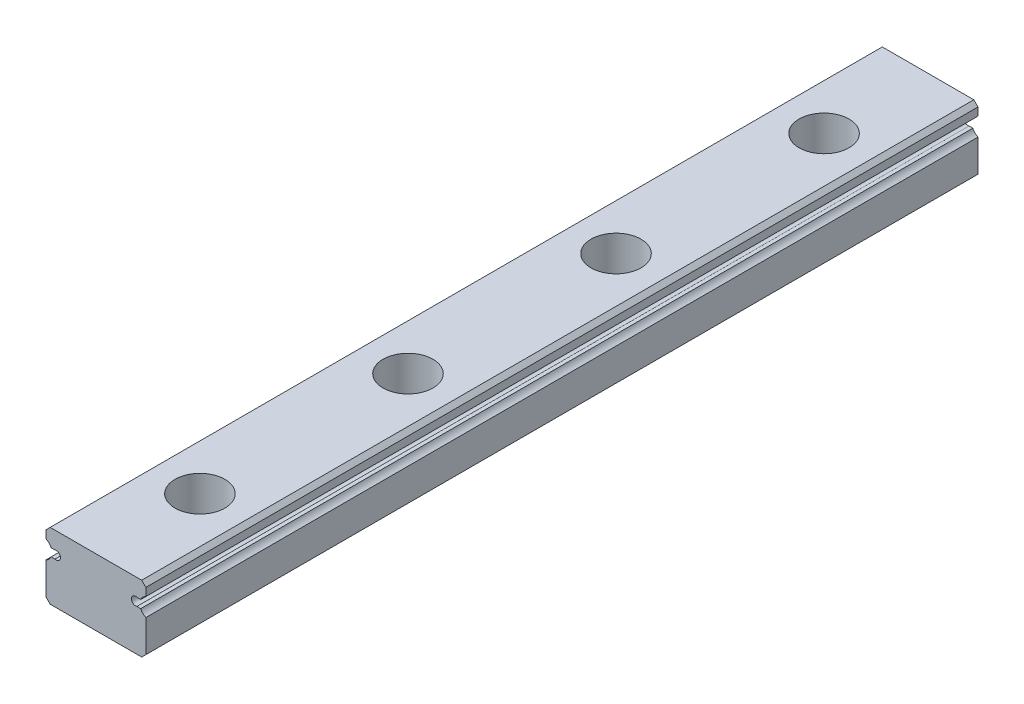
ISO-10303-21;
HEADER;
FILE_DESCRIPTION(('STEP AP214'),'2;1');
FILE_NAME('part.step','',(''),(''),'','','');
FILE_SCHEMA(('AUTOMOTIVE_DESIGN { 1 0 10303 214 1 1 1 1 }'));
ENDSEC;
DATA;
#1=APPLICATION_CONTEXT('core data for automotive mechanical design processes');
#2=APPLICATION_PROTOCOL_DEFINITION('international standard','automotive_design',2000,#1);
#3=PRODUCT_CONTEXT('',#1,'mechanical');
#4=PRODUCT('Part','Part','',(#3));
#5=PRODUCT_RELATED_PRODUCT_CATEGORY('part','',(#4));
#6=PRODUCT_DEFINITION_FORMATION('','',#4);
#7=PRODUCT_DEFINITION_CONTEXT('part definition',#1,'design');
#8=PRODUCT_DEFINITION('design','',#6,#7);
#9=PRODUCT_DEFINITION_SHAPE('','',#8);
#10=(LENGTH_UNIT() NAMED_UNIT(*) SI_UNIT(.MILLI.,.METRE.));
#11=(NAMED_UNIT(*) PLANE_ANGLE_UNIT() SI_UNIT($,.RADIAN.));
#12=(NAMED_UNIT(*) SI_UNIT($,.STERADIAN.) SOLID_ANGLE_UNIT());
#13=UNCERTAINTY_MEASURE_WITH_UNIT(LENGTH_MEASURE(1.E-05),#10,'distance_accuracy_value','');
#14=(GEOMETRIC_REPRESENTATION_CONTEXT(3) GLOBAL_UNCERTAINTY_ASSIGNED_CONTEXT((#13)) GLOBAL_UNIT_ASSIGNED_CONTEXT((#10,
#11,#12)) REPRESENTATION_CONTEXT('',''));
#15=CARTESIAN_POINT('',(0.,0.,0.));
#16=DIRECTION('',(0.,0.,1.));
#17=DIRECTION('',(1.,0.,0.));
#18=AXIS2_PLACEMENT_3D('',#15,#16,#17);
#19=CARTESIAN_POINT('',(6.,0.,100.));
#20=DIRECTION('',(-1.,0.,0.));
#21=DIRECTION('',(0.,0.,1.));
#22=AXIS2_PLACEMENT_3D('',#19,#20,#21);
#23=PLANE('',#22);
#24=DIRECTION('',(0.,1.,0.));
#25=VECTOR('',#24,1.);
#26=CARTESIAN_POINT('',(6.,0.,0.));
#27=LINE('',#26,#25);
#28=CARTESIAN_POINT('',(6.,-3.5,0.));
#29=VERTEX_POINT('',#28);
#30=CARTESIAN_POINT('',(6.,0.368911094364901,0.));
#31=VERTEX_POINT('',#30);
#32=EDGE_CURVE('E219',#29,#31,#27,.T.);
#33=ORIENTED_EDGE('',*,*,#32,.T.);
#34=DIRECTION('',(0.,0.,-1.));
#35=VECTOR('',#34,1.);
#36=CARTESIAN_POINT('',(6.,0.368911094364901,100.));
#37=LINE('',#36,#35);
#38=CARTESIAN_POINT('',(6.,0.368911094364901,100.));
#39=VERTEX_POINT('',#38);
#40=EDGE_CURVE('E11',#39,#31,#37,.T.);
#41=ORIENTED_EDGE('',*,*,#40,.F.);
#42=DIRECTION('',(0.,1.,0.));
#43=VECTOR('',#42,1.);
#44=CARTESIAN_POINT('',(6.,0.,100.));
#45=LINE('',#44,#43);
#46=CARTESIAN_POINT('',(6.,-3.5,100.));
#47=VERTEX_POINT('',#46);
#48=EDGE_CURVE('E291',#47,#39,#45,.T.);
#49=ORIENTED_EDGE('',*,*,#48,.F.);
#50=DIRECTION('',(0.,0.,-1.));
#51=VECTOR('',#50,1.);
#52=CARTESIAN_POINT('',(6.,-3.5,100.));
#53=LINE('',#52,#51);
#54=EDGE_CURVE('E215',#47,#29,#53,.T.);
#55=ORIENTED_EDGE('',*,*,#54,.T.);
#56=EDGE_LOOP('',(#33,#41,#49,#55));
#57=FACE_BOUND('',#56,.T.);
#58=ADVANCED_FACE('F47',(#57),#23,.F.);
#59=CARTESIAN_POINT('',(6.475,1.46,100.));
#60=DIRECTION('',(0.,0.,-1.));
#61=DIRECTION('',(-1.,0.,0.));
#62=AXIS2_PLACEMENT_3D('',#59,#60,#61);
#63=CYLINDRICAL_SURFACE('',#62,1.19);
#64=CARTESIAN_POINT('',(6.475,1.46,0.));
#65=DIRECTION('',(0.,0.,1.));
#66=DIRECTION('',(1.,0.,0.));
#67=AXIS2_PLACEMENT_3D('',#64,#65,#66);
#68=CIRCLE('',#67,1.19);
#69=CARTESIAN_POINT('',(5.3839110943649,0.985,0.));
#70=VERTEX_POINT('',#69);
#71=EDGE_CURVE('E223',#31,#70,#68,.F.);
#72=ORIENTED_EDGE('',*,*,#71,.T.);
#73=DIRECTION('',(0.,0.,-1.));
#74=VECTOR('',#73,1.);
#75=CARTESIAN_POINT('',(5.3839110943649,0.985,100.));
#76=LINE('',#75,#74);
#77=CARTESIAN_POINT('',(5.3839110943649,0.985,100.));
#78=VERTEX_POINT('',#77);
#79=EDGE_CURVE('E56',#78,#70,#76,.T.);
#80=ORIENTED_EDGE('',*,*,#79,.F.);
#81=CARTESIAN_POINT('',(6.475,1.46,100.));
#82=DIRECTION('',(0.,0.,1.));
#83=DIRECTION('',(1.,0.,0.));
#84=AXIS2_PLACEMENT_3D('',#81,#82,#83);
#85=CIRCLE('',#84,1.19);
#86=EDGE_CURVE('E139',#39,#78,#85,.F.);
#87=ORIENTED_EDGE('',*,*,#86,.F.);
#88=ORIENTED_EDGE('',*,*,#40,.T.);
#89=EDGE_LOOP('',(#72,#80,#87,#88));
#90=FACE_BOUND('',#89,.T.);
#91=ADVANCED_FACE('F430',(#90),#63,.F.);
#92=CARTESIAN_POINT('',(0.,0.985000000000015,100.));
#93=DIRECTION('',(0.,-1.,0.));
#94=DIRECTION('',(1.,0.,0.));
#95=AXIS2_PLACEMENT_3D('',#92,#93,#94);
#96=PLANE('',#95);
#97=DIRECTION('',(-1.,0.,0.));
#98=VECTOR('',#97,1.);
#99=CARTESIAN_POINT('',(0.,0.985000000000015,0.));
#100=LINE('',#99,#98);
#101=CARTESIAN_POINT('',(4.92112494995996,0.985000000000002,0.));
#102=VERTEX_POINT('',#101);
#103=EDGE_CURVE('E227',#70,#102,#100,.T.);
#104=ORIENTED_EDGE('',*,*,#103,.T.);
#105=DIRECTION('',(0.,0.,-1.));
#106=VECTOR('',#105,1.);
#107=CARTESIAN_POINT('',(4.92112494995996,0.985000000000002,100.));
#108=LINE('',#107,#106);
#109=CARTESIAN_POINT('',(4.92112494995996,0.985000000000002,100.));
#110=VERTEX_POINT('',#109);
#111=EDGE_CURVE('E339',#110,#102,#108,.T.);
#112=ORIENTED_EDGE('',*,*,#111,.F.);
#113=DIRECTION('',(-1.,0.,0.));
#114=VECTOR('',#113,1.);
#115=CARTESIAN_POINT('',(0.,0.985000000000015,100.));
#116=LINE('',#115,#114);
#117=EDGE_CURVE('E349',#78,#110,#116,.T.);
#118=ORIENTED_EDGE('',*,*,#117,.F.);
#119=ORIENTED_EDGE('',*,*,#79,.T.);
#120=EDGE_LOOP('',(#104,#112,#118,#119));
#121=FACE_BOUND('',#120,.T.);
#122=ADVANCED_FACE('F347',(#121),#96,.F.);
#123=CARTESIAN_POINT('',(4.765,1.46,100.));
#124=DIRECTION('',(0.,0.,-1.));
#125=DIRECTION('',(-1.,0.,0.));
#126=AXIS2_PLACEMENT_3D('',#123,#124,#125);
#127=CYLINDRICAL_SURFACE('',#126,0.5);
#128=CARTESIAN_POINT('',(4.765,1.46,0.));
#129=DIRECTION('',(0.,0.,1.));
#130=DIRECTION('',(1.,0.,0.));
#131=AXIS2_PLACEMENT_3D('',#128,#129,#130);
#132=CIRCLE('',#131,0.5);
#133=CARTESIAN_POINT('',(4.92112494995996,1.935,0.));
#134=VERTEX_POINT('',#133);
#135=EDGE_CURVE('E230',#102,#134,#132,.F.);
#136=ORIENTED_EDGE('',*,*,#135,.T.);
#137=DIRECTION('',(0.,0.,-1.));
#138=VECTOR('',#137,1.);
#139=CARTESIAN_POINT('',(4.92112494995996,1.935,100.));
#140=LINE('',#139,#138);
#141=CARTESIAN_POINT('',(4.92112494995996,1.935,100.));
#142=VERTEX_POINT('',#141);
#143=EDGE_CURVE('E336',#142,#134,#140,.T.);
#144=ORIENTED_EDGE('',*,*,#143,.F.);
#145=CARTESIAN_POINT('',(4.765,1.46,100.));
#146=DIRECTION('',(0.,0.,1.));
#147=DIRECTION('',(1.,0.,0.));
#148=AXIS2_PLACEMENT_3D('',#145,#146,#147);
#149=CIRCLE('',#148,0.5);
#150=EDGE_CURVE('E361',#110,#142,#149,.F.);
#151=ORIENTED_EDGE('',*,*,#150,.F.);
#152=ORIENTED_EDGE('',*,*,#111,.T.);
#153=EDGE_LOOP('',(#136,#144,#151,#152));
#154=FACE_BOUND('',#153,.T.);
#155=ADVANCED_FACE('F358',(#154),#127,.F.);
#156=CARTESIAN_POINT('',(0.,1.93500000000002,100.));
#157=DIRECTION('',(0.,-1.,0.));
#158=DIRECTION('',(1.,0.,0.));
#159=AXIS2_PLACEMENT_3D('',#156,#157,#158);
#160=PLANE('',#159);
#161=DIRECTION('',(-1.,0.,0.));
#162=VECTOR('',#161,1.);
#163=CARTESIAN_POINT('',(0.,1.93500000000002,0.));
#164=LINE('',#163,#162);
#165=CARTESIAN_POINT('',(5.3839110943649,1.935,0.));
#166=VERTEX_POINT('',#165);
#167=EDGE_CURVE('E234',#166,#134,#164,.T.);
#168=ORIENTED_EDGE('',*,*,#167,.F.);
#169=DIRECTION('',(0.,0.,-1.));
#170=VECTOR('',#169,1.);
#171=CARTESIAN_POINT('',(5.3839110943649,1.935,100.));
#172=LINE('',#171,#170);
#173=CARTESIAN_POINT('',(5.3839110943649,1.935,100.));
#174=VERTEX_POINT('',#173);
#175=EDGE_CURVE('E333',#174,#166,#172,.T.);
#176=ORIENTED_EDGE('',*,*,#175,.F.);
#177=DIRECTION('',(-1.,0.,0.));
#178=VECTOR('',#177,1.);
#179=CARTESIAN_POINT('',(0.,1.93500000000002,100.));
#180=LINE('',#179,#178);
#181=EDGE_CURVE('E364',#174,#142,#180,.T.);
#182=ORIENTED_EDGE('',*,*,#181,.T.);
#183=ORIENTED_EDGE('',*,*,#143,.T.);
#184=EDGE_LOOP('',(#168,#176,#182,#183));
#185=FACE_BOUND('',#184,.T.);
#186=ADVANCED_FACE('F441',(#185),#160,.T.);
#187=CARTESIAN_POINT('',(6.475,1.46,100.));
#188=DIRECTION('',(0.,0.,-1.));
#189=DIRECTION('',(-1.,0.,0.));
#190=AXIS2_PLACEMENT_3D('',#187,#188,#189);
#191=CYLINDRICAL_SURFACE('',#190,1.19);
#192=CARTESIAN_POINT('',(6.475,1.46,0.));
#193=DIRECTION('',(0.,0.,1.));
#194=DIRECTION('',(1.,0.,0.));
#195=AXIS2_PLACEMENT_3D('',#192,#193,#194);
#196=CIRCLE('',#195,1.19);
#197=CARTESIAN_POINT('',(6.,2.5510889056351,0.));
#198=VERTEX_POINT('',#197);
#199=EDGE_CURVE('E238',#166,#198,#196,.F.);
#200=ORIENTED_EDGE('',*,*,#199,.T.);
#201=DIRECTION('',(0.,0.,-1.));
#202=VECTOR('',#201,1.);
#203=CARTESIAN_POINT('',(6.,2.5510889056351,100.));
#204=LINE('',#203,#202);
#205=CARTESIAN_POINT('',(6.,2.5510889056351,100.));
#206=VERTEX_POINT('',#205);
#207=EDGE_CURVE('E329',#206,#198,#204,.T.);
#208=ORIENTED_EDGE('',*,*,#207,.F.);
#209=CARTESIAN_POINT('',(6.475,1.46,100.));
#210=DIRECTION('',(0.,0.,1.));
#211=DIRECTION('',(1.,0.,0.));
#212=AXIS2_PLACEMENT_3D('',#209,#210,#211);
#213=CIRCLE('',#212,1.19);
#214=EDGE_CURVE('E368',#174,#206,#213,.F.);
#215=ORIENTED_EDGE('',*,*,#214,.F.);
#216=ORIENTED_EDGE('',*,*,#175,.T.);
#217=EDGE_LOOP('',(#200,#208,#215,#216));
#218=FACE_BOUND('',#217,.T.);
#219=ADVANCED_FACE('F444',(#218),#191,.F.);
#220=CARTESIAN_POINT('',(6.00000000000001,0.,100.));
#221=DIRECTION('',(-1.,0.,0.));
#222=DIRECTION('',(0.,-1.,0.));
#223=AXIS2_PLACEMENT_3D('',#220,#221,#222);
#224=PLANE('',#223);
#225=DIRECTION('',(0.,1.,0.));
#226=VECTOR('',#225,1.);
#227=CARTESIAN_POINT('',(6.00000000000001,0.,0.));
#228=LINE('',#227,#226);
#229=CARTESIAN_POINT('',(6.,3.5,0.));
#230=VERTEX_POINT('',#229);
#231=EDGE_CURVE('E241',#198,#230,#228,.T.);
#232=ORIENTED_EDGE('',*,*,#231,.T.);
#233=DIRECTION('',(0.,0.,-1.));
#234=VECTOR('',#233,1.);
#235=CARTESIAN_POINT('',(6.,3.5,100.));
#236=LINE('',#235,#234);
#237=CARTESIAN_POINT('',(6.,3.5,100.));
#238=VERTEX_POINT('',#237);
#239=EDGE_CURVE('E326',#238,#230,#236,.T.);
#240=ORIENTED_EDGE('',*,*,#239,.F.);
#241=DIRECTION('',(0.,1.,0.));
#242=VECTOR('',#241,1.);
#243=CARTESIAN_POINT('',(6.00000000000001,0.,100.));
#244=LINE('',#243,#242);
#245=EDGE_CURVE('E375',#206,#238,#244,.T.);
#246=ORIENTED_EDGE('',*,*,#245,.F.);
#247=ORIENTED_EDGE('',*,*,#207,.T.);
#248=EDGE_LOOP('',(#232,#240,#246,#247));
#249=FACE_BOUND('',#248,.T.);
#250=ADVANCED_FACE('F448',(#249),#224,.F.);
#251=CARTESIAN_POINT('',(4.74999999999999,4.75,100.));
#252=DIRECTION('',(0.707106781186547,0.707106781186548,0.));
#253=DIRECTION('',(-0.707106781186548,0.707106781186547,0.));
#254=AXIS2_PLACEMENT_3D('',#251,#252,#253);
#255=PLANE('',#254);
#256=DIRECTION('',(0.707106781186548,-0.707106781186547,0.));
#257=VECTOR('',#256,1.);
#258=CARTESIAN_POINT('',(4.74999999999999,4.75,0.));
#259=LINE('',#258,#257);
#260=CARTESIAN_POINT('',(5.5,4.,0.));
#261=VERTEX_POINT('',#260);
#262=EDGE_CURVE('E245',#261,#230,#259,.T.);
#263=ORIENTED_EDGE('',*,*,#262,.F.);
#264=DIRECTION('',(0.,0.,-1.));
#265=VECTOR('',#264,1.);
#266=CARTESIAN_POINT('',(5.5,4.,100.));
#267=LINE('',#266,#265);
#268=CARTESIAN_POINT('',(5.5,4.,100.));
#269=VERTEX_POINT('',#268);
#270=EDGE_CURVE('E323',#269,#261,#267,.T.);
#271=ORIENTED_EDGE('',*,*,#270,.F.);
#272=DIRECTION('',(0.707106781186548,-0.707106781186547,0.));
#273=VECTOR('',#272,1.);
#274=CARTESIAN_POINT('',(4.74999999999999,4.75,100.));
#275=LINE('',#274,#273);
#276=EDGE_CURVE('E378',#269,#238,#275,.T.);
#277=ORIENTED_EDGE('',*,*,#276,.T.);
#278=ORIENTED_EDGE('',*,*,#239,.T.);
#279=EDGE_LOOP('',(#263,#271,#277,#278));
#280=FACE_BOUND('',#279,.T.);
#281=ADVANCED_FACE('F452',(#280),#255,.T.);
#282=CARTESIAN_POINT('',(0.,4.,100.));
#283=DIRECTION('',(0.,-1.,0.));
#284=DIRECTION('',(1.,0.,0.));
#285=AXIS2_PLACEMENT_3D('',#282,#283,#284);
#286=PLANE('',#285);
#287=CARTESIAN_POINT('',(0.,4.,87.5));
#288=DIRECTION('',(0.,1.,0.));
#289=DIRECTION('',(-1.,0.,0.));
#290=AXIS2_PLACEMENT_3D('',#287,#288,#289);
#291=CIRCLE('',#290,3.);
#292=CARTESIAN_POINT('',(-3.,4.,87.5));
#293=VERTEX_POINT('',#292);
#294=EDGE_CURVE('E802',#293,#293,#291,.T.);
#295=ORIENTED_EDGE('',*,*,#294,.F.);
#296=EDGE_LOOP('',(#295));
#297=FACE_BOUND('',#296,.T.);
#298=CARTESIAN_POINT('',(0.,4.,62.5));
#299=DIRECTION('',(0.,1.,0.));
#300=DIRECTION('',(-1.,0.,0.));
#301=AXIS2_PLACEMENT_3D('',#298,#299,#300);
#302=CIRCLE('',#301,3.);
#303=CARTESIAN_POINT('',(-3.,4.,62.5));
#304=VERTEX_POINT('',#303);
#305=EDGE_CURVE('E816',#304,#304,#302,.T.);
#306=ORIENTED_EDGE('',*,*,#305,.F.);
#307=EDGE_LOOP('',(#306));
#308=FACE_BOUND('',#307,.T.);
#309=CARTESIAN_POINT('',(0.,4.,37.5));
#310=DIRECTION('',(0.,1.,0.));
#311=DIRECTION('',(-1.,0.,0.));
#312=AXIS2_PLACEMENT_3D('',#309,#310,#311);
#313=CIRCLE('',#312,3.);
#314=CARTESIAN_POINT('',(-3.,4.,37.5));
#315=VERTEX_POINT('',#314);
#316=EDGE_CURVE('E832',#315,#315,#313,.T.);
#317=ORIENTED_EDGE('',*,*,#316,.F.);
#318=EDGE_LOOP('',(#317));
#319=FACE_BOUND('',#318,.T.);
#320=CARTESIAN_POINT('',(0.,4.,12.5));
#321=DIRECTION('',(0.,1.,0.));
#322=DIRECTION('',(-1.,0.,0.));
#323=AXIS2_PLACEMENT_3D('',#320,#321,#322);
#324=CIRCLE('',#323,3.);
#325=CARTESIAN_POINT('',(-3.,4.,12.5));
#326=VERTEX_POINT('',#325);
#327=EDGE_CURVE('E849',#326,#326,#324,.T.);
#328=ORIENTED_EDGE('',*,*,#327,.F.);
#329=EDGE_LOOP('',(#328));
#330=FACE_BOUND('',#329,.T.);
#331=DIRECTION('',(-1.,0.,0.));
#332=VECTOR('',#331,1.);
#333=CARTESIAN_POINT('',(0.,4.,0.));
#334=LINE('',#333,#332);
#335=CARTESIAN_POINT('',(-5.5,4.,0.));
#336=VERTEX_POINT('',#335);
#337=EDGE_CURVE('E249',#261,#336,#334,.T.);
#338=ORIENTED_EDGE('',*,*,#337,.T.);
#339=DIRECTION('',(0.,0.,-1.));
#340=VECTOR('',#339,1.);
#341=CARTESIAN_POINT('',(-5.5,4.,100.));
#342=LINE('',#341,#340);
#343=CARTESIAN_POINT('',(-5.5,4.,100.));
#344=VERTEX_POINT('',#343);
#345=EDGE_CURVE('E319',#344,#336,#342,.T.);
#346=ORIENTED_EDGE('',*,*,#345,.F.);
#347=DIRECTION('',(-1.,0.,0.));
#348=VECTOR('',#347,1.);
#349=CARTESIAN_POINT('',(0.,4.,100.));
#350=LINE('',#349,#348);
#351=EDGE_CURVE('E382',#269,#344,#350,.T.);
#352=ORIENTED_EDGE('',*,*,#351,.F.);
#353=ORIENTED_EDGE('',*,*,#270,.T.);
#354=EDGE_LOOP('',(#338,#346,#352,#353));
#355=FACE_BOUND('',#354,.T.);
#356=ADVANCED_FACE('F456',(#297,#308,#319,#330,#355),#286,.F.);
#357=CARTESIAN_POINT('',(-4.75,4.75,100.));
#358=DIRECTION('',(0.707106781186547,-0.707106781186548,0.));
#359=DIRECTION('',(0.707106781186548,0.707106781186547,0.));
#360=AXIS2_PLACEMENT_3D('',#357,#358,#359);
#361=PLANE('',#360);
#362=DIRECTION('',(-0.707106781186548,-0.707106781186547,0.));
#363=VECTOR('',#362,1.);
#364=CARTESIAN_POINT('',(-4.75,4.75,0.));
#365=LINE('',#364,#363);
#366=CARTESIAN_POINT('',(-6.,3.5,0.));
#367=VERTEX_POINT('',#366);
#368=EDGE_CURVE('E252',#336,#367,#365,.T.);
#369=ORIENTED_EDGE('',*,*,#368,.T.);
#370=DIRECTION('',(0.,0.,-1.));
#371=VECTOR('',#370,1.);
#372=CARTESIAN_POINT('',(-6.,3.5,100.));
#373=LINE('',#372,#371);
#374=CARTESIAN_POINT('',(-6.,3.5,100.));
#375=VERTEX_POINT('',#374);
#376=EDGE_CURVE('E316',#375,#367,#373,.T.);
#377=ORIENTED_EDGE('',*,*,#376,.F.);
#378=DIRECTION('',(-0.707106781186548,-0.707106781186547,0.));
#379=VECTOR('',#378,1.);
#380=CARTESIAN_POINT('',(-4.75,4.75,100.));
#381=LINE('',#380,#379);
#382=EDGE_CURVE('E385',#344,#375,#381,.T.);
#383=ORIENTED_EDGE('',*,*,#382,.F.);
#384=ORIENTED_EDGE('',*,*,#345,.T.);
#385=EDGE_LOOP('',(#369,#377,#383,#384));
#386=FACE_BOUND('',#385,.T.);
#387=ADVANCED_FACE('F460',(#386),#361,.F.);
#388=CARTESIAN_POINT('',(-6.,0.,100.));
#389=DIRECTION('',(-1.,0.,0.));
#390=DIRECTION('',(0.,0.,1.));
#391=AXIS2_PLACEMENT_3D('',#388,#389,#390);
#392=PLANE('',#391);
#393=DIRECTION('',(0.,1.,0.));
#394=VECTOR('',#393,1.);
#395=CARTESIAN_POINT('',(-6.,0.,0.));
#396=LINE('',#395,#394);
#397=CARTESIAN_POINT('',(-6.,2.5510889056351,0.));
#398=VERTEX_POINT('',#397);
#399=EDGE_CURVE('E256',#398,#367,#396,.T.);
#400=ORIENTED_EDGE('',*,*,#399,.F.);
#401=DIRECTION('',(0.,0.,-1.));
#402=VECTOR('',#401,1.);
#403=CARTESIAN_POINT('',(-6.,2.5510889056351,100.));
#404=LINE('',#403,#402);
#405=CARTESIAN_POINT('',(-6.,2.5510889056351,100.));
#406=VERTEX_POINT('',#405);
#407=EDGE_CURVE('E313',#406,#398,#404,.T.);
#408=ORIENTED_EDGE('',*,*,#407,.F.);
#409=DIRECTION('',(0.,1.,0.));
#410=VECTOR('',#409,1.);
#411=CARTESIAN_POINT('',(-6.,0.,100.));
#412=LINE('',#411,#410);
#413=EDGE_CURVE('E388',#406,#375,#412,.T.);
#414=ORIENTED_EDGE('',*,*,#413,.T.);
#415=ORIENTED_EDGE('',*,*,#376,.T.);
#416=EDGE_LOOP('',(#400,#408,#414,#415));
#417=FACE_BOUND('',#416,.T.);
#418=ADVANCED_FACE('F464',(#417),#392,.T.);
#419=CARTESIAN_POINT('',(-6.475,1.46,100.));
#420=DIRECTION('',(0.,0.,-1.));
#421=DIRECTION('',(-1.,0.,0.));
#422=AXIS2_PLACEMENT_3D('',#419,#420,#421);
#423=CYLINDRICAL_SURFACE('',#422,1.19);
#424=CARTESIAN_POINT('',(-6.475,1.46,0.));
#425=DIRECTION('',(0.,0.,1.));
#426=DIRECTION('',(1.,0.,0.));
#427=AXIS2_PLACEMENT_3D('',#424,#425,#426);
#428=CIRCLE('',#427,1.19);
#429=CARTESIAN_POINT('',(-5.3839110943649,1.935,0.));
#430=VERTEX_POINT('',#429);
#431=EDGE_CURVE('E260',#430,#398,#428,.T.);
#432=ORIENTED_EDGE('',*,*,#431,.F.);
#433=DIRECTION('',(0.,0.,-1.));
#434=VECTOR('',#433,1.);
#435=CARTESIAN_POINT('',(-5.3839110943649,1.935,100.));
#436=LINE('',#435,#434);
#437=CARTESIAN_POINT('',(-5.3839110943649,1.935,100.));
#438=VERTEX_POINT('',#437);
#439=EDGE_CURVE('E310',#438,#430,#436,.T.);
#440=ORIENTED_EDGE('',*,*,#439,.F.);
#441=CARTESIAN_POINT('',(-6.475,1.46,100.));
#442=DIRECTION('',(0.,0.,1.));
#443=DIRECTION('',(1.,0.,0.));
#444=AXIS2_PLACEMENT_3D('',#441,#442,#443);
#445=CIRCLE('',#444,1.19);
#446=EDGE_CURVE('E392',#438,#406,#445,.T.);
#447=ORIENTED_EDGE('',*,*,#446,.T.);
#448=ORIENTED_EDGE('',*,*,#407,.T.);
#449=EDGE_LOOP('',(#432,#440,#447,#448));
#450=FACE_BOUND('',#449,.T.);
#451=ADVANCED_FACE('F468',(#450),#423,.F.);
#452=CARTESIAN_POINT('',(0.,1.935,100.));
#453=DIRECTION('',(0.,1.,0.));
#454=DIRECTION('',(0.,0.,1.));
#455=AXIS2_PLACEMENT_3D('',#452,#453,#454);
#456=PLANE('',#455);
#457=DIRECTION('',(1.,0.,0.));
#458=VECTOR('',#457,1.);
#459=CARTESIAN_POINT('',(0.,1.935,0.));
#460=LINE('',#459,#458);
#461=CARTESIAN_POINT('',(-4.92112494995996,1.935,0.));
#462=VERTEX_POINT('',#461);
#463=EDGE_CURVE('E264',#430,#462,#460,.T.);
#464=ORIENTED_EDGE('',*,*,#463,.T.);
#465=DIRECTION('',(0.,0.,-1.));
#466=VECTOR('',#465,1.);
#467=CARTESIAN_POINT('',(-4.92112494995996,1.935,100.));
#468=LINE('',#467,#466);
#469=CARTESIAN_POINT('',(-4.92112494995996,1.935,100.));
#470=VERTEX_POINT('',#469);
#471=EDGE_CURVE('E307',#470,#462,#468,.T.);
#472=ORIENTED_EDGE('',*,*,#471,.F.);
#473=DIRECTION('',(1.,0.,0.));
#474=VECTOR('',#473,1.);
#475=CARTESIAN_POINT('',(0.,1.935,100.));
#476=LINE('',#475,#474);
#477=EDGE_CURVE('E396',#438,#470,#476,.T.);
#478=ORIENTED_EDGE('',*,*,#477,.F.);
#479=ORIENTED_EDGE('',*,*,#439,.T.);
#480=EDGE_LOOP('',(#464,#472,#478,#479));
#481=FACE_BOUND('',#480,.T.);
#482=ADVANCED_FACE('F472',(#481),#456,.F.);
#483=CARTESIAN_POINT('',(-4.765,1.46,100.));
#484=DIRECTION('',(0.,0.,-1.));
#485=DIRECTION('',(-1.,0.,0.));
#486=AXIS2_PLACEMENT_3D('',#483,#484,#485);
#487=CYLINDRICAL_SURFACE('',#486,0.5);
#488=CARTESIAN_POINT('',(-4.765,1.46,0.));
#489=DIRECTION('',(0.,0.,1.));
#490=DIRECTION('',(1.,0.,0.));
#491=AXIS2_PLACEMENT_3D('',#488,#489,#490);
#492=CIRCLE('',#491,0.5);
#493=CARTESIAN_POINT('',(-4.92112494995996,0.984999999999999,0.));
#494=VERTEX_POINT('',#493);
#495=EDGE_CURVE('E268',#494,#462,#492,.T.);
#496=ORIENTED_EDGE('',*,*,#495,.F.);
#497=DIRECTION('',(0.,0.,-1.));
#498=VECTOR('',#497,1.);
#499=CARTESIAN_POINT('',(-4.92112494995996,0.984999999999999,100.));
#500=LINE('',#499,#498);
#501=CARTESIAN_POINT('',(-4.92112494995996,0.984999999999999,100.));
#502=VERTEX_POINT('',#501);
#503=EDGE_CURVE('E304',#502,#494,#500,.T.);
#504=ORIENTED_EDGE('',*,*,#503,.F.);
#505=CARTESIAN_POINT('',(-4.765,1.46,100.));
#506=DIRECTION('',(0.,0.,1.));
#507=DIRECTION('',(1.,0.,0.));
#508=AXIS2_PLACEMENT_3D('',#505,#506,#507);
#509=CIRCLE('',#508,0.5);
#510=EDGE_CURVE('E399',#502,#470,#509,.T.);
#511=ORIENTED_EDGE('',*,*,#510,.T.);
#512=ORIENTED_EDGE('',*,*,#471,.T.);
#513=EDGE_LOOP('',(#496,#504,#511,#512));
#514=FACE_BOUND('',#513,.T.);
#515=ADVANCED_FACE('F476',(#514),#487,.F.);
#516=CARTESIAN_POINT('',(0.,0.984999999999999,100.));
#517=DIRECTION('',(0.,1.,0.));
#518=DIRECTION('',(0.,0.,1.));
#519=AXIS2_PLACEMENT_3D('',#516,#517,#518);
#520=PLANE('',#519);
#521=DIRECTION('',(1.,0.,0.));
#522=VECTOR('',#521,1.);
#523=CARTESIAN_POINT('',(0.,0.984999999999999,0.));
#524=LINE('',#523,#522);
#525=CARTESIAN_POINT('',(-5.3839110943649,0.984999999999999,0.));
#526=VERTEX_POINT('',#525);
#527=EDGE_CURVE('E272',#526,#494,#524,.T.);
#528=ORIENTED_EDGE('',*,*,#527,.F.);
#529=DIRECTION('',(0.,0.,-1.));
#530=VECTOR('',#529,1.);
#531=CARTESIAN_POINT('',(-5.3839110943649,0.984999999999999,100.));
#532=LINE('',#531,#530);
#533=CARTESIAN_POINT('',(-5.3839110943649,0.984999999999999,100.));
#534=VERTEX_POINT('',#533);
#535=EDGE_CURVE('E301',#534,#526,#532,.T.);
#536=ORIENTED_EDGE('',*,*,#535,.F.);
#537=DIRECTION('',(1.,0.,0.));
#538=VECTOR('',#537,1.);
#539=CARTESIAN_POINT('',(0.,0.984999999999999,100.));
#540=LINE('',#539,#538);
#541=EDGE_CURVE('E403',#534,#502,#540,.T.);
#542=ORIENTED_EDGE('',*,*,#541,.T.);
#543=ORIENTED_EDGE('',*,*,#503,.T.);
#544=EDGE_LOOP('',(#528,#536,#542,#543));
#545=FACE_BOUND('',#544,.T.);
#546=ADVANCED_FACE('F480',(#545),#520,.T.);
#547=CARTESIAN_POINT('',(-6.475,1.46,100.));
#548=DIRECTION('',(0.,0.,-1.));
#549=DIRECTION('',(-1.,0.,0.));
#550=AXIS2_PLACEMENT_3D('',#547,#548,#549);
#551=CYLINDRICAL_SURFACE('',#550,1.19);
#552=CARTESIAN_POINT('',(-6.475,1.46,0.));
#553=DIRECTION('',(0.,0.,1.));
#554=DIRECTION('',(1.,0.,0.));
#555=AXIS2_PLACEMENT_3D('',#552,#553,#554);
#556=CIRCLE('',#555,1.19);
#557=CARTESIAN_POINT('',(-6.,0.3689110943649,0.));
#558=VERTEX_POINT('',#557);
#559=EDGE_CURVE('E276',#558,#526,#556,.T.);
#560=ORIENTED_EDGE('',*,*,#559,.F.);
#561=DIRECTION('',(0.,0.,-1.));
#562=VECTOR('',#561,1.);
#563=CARTESIAN_POINT('',(-6.,0.3689110943649,100.));
#564=LINE('',#563,#562);
#565=CARTESIAN_POINT('',(-6.,0.3689110943649,100.));
#566=VERTEX_POINT('',#565);
#567=EDGE_CURVE('E298',#566,#558,#564,.T.);
#568=ORIENTED_EDGE('',*,*,#567,.F.);
#569=CARTESIAN_POINT('',(-6.475,1.46,100.));
#570=DIRECTION('',(0.,0.,1.));
#571=DIRECTION('',(1.,0.,0.));
#572=AXIS2_PLACEMENT_3D('',#569,#570,#571);
#573=CIRCLE('',#572,1.19);
#574=EDGE_CURVE('E407',#566,#534,#573,.T.);
#575=ORIENTED_EDGE('',*,*,#574,.T.);
#576=ORIENTED_EDGE('',*,*,#535,.T.);
#577=EDGE_LOOP('',(#560,#568,#575,#576));
#578=FACE_BOUND('',#577,.T.);
#579=ADVANCED_FACE('F484',(#578),#551,.F.);
#580=CARTESIAN_POINT('',(-6.,0.,100.));
#581=DIRECTION('',(-1.,0.,0.));
#582=DIRECTION('',(0.,0.,1.));
#583=AXIS2_PLACEMENT_3D('',#580,#581,#582);
#584=PLANE('',#583);
#585=DIRECTION('',(0.,1.,0.));
#586=VECTOR('',#585,1.);
#587=CARTESIAN_POINT('',(-6.,0.,0.));
#588=LINE('',#587,#586);
#589=CARTESIAN_POINT('',(-6.,-3.5,0.));
#590=VERTEX_POINT('',#589);
#591=EDGE_CURVE('E280',#590,#558,#588,.T.);
#592=ORIENTED_EDGE('',*,*,#591,.F.);
#593=DIRECTION('',(0.,0.,-1.));
#594=VECTOR('',#593,1.);
#595=CARTESIAN_POINT('',(-6.,-3.5,100.));
#596=LINE('',#595,#594);
#597=CARTESIAN_POINT('',(-6.,-3.5,100.));
#598=VERTEX_POINT('',#597);
#599=EDGE_CURVE('E201',#598,#590,#596,.T.);
#600=ORIENTED_EDGE('',*,*,#599,.F.);
#601=DIRECTION('',(0.,1.,0.));
#602=VECTOR('',#601,1.);
#603=CARTESIAN_POINT('',(-6.,0.,100.));
#604=LINE('',#603,#602);
#605=EDGE_CURVE('E208',#598,#566,#604,.T.);
#606=ORIENTED_EDGE('',*,*,#605,.T.);
#607=ORIENTED_EDGE('',*,*,#567,.T.);
#608=EDGE_LOOP('',(#592,#600,#606,#607));
#609=FACE_BOUND('',#608,.T.);
#610=ADVANCED_FACE('F413',(#609),#584,.T.);
#611=CARTESIAN_POINT('',(-4.75,-4.75,100.));
#612=DIRECTION('',(-0.707106781186548,-0.707106781186547,0.));
#613=DIRECTION('',(0.707106781186547,-0.707106781186548,0.));
#614=AXIS2_PLACEMENT_3D('',#611,#612,#613);
#615=PLANE('',#614);
#616=DIRECTION('',(-0.707106781186547,0.707106781186548,0.));
#617=VECTOR('',#616,1.);
#618=CARTESIAN_POINT('',(-4.75,-4.75,0.));
#619=LINE('',#618,#617);
#620=CARTESIAN_POINT('',(-5.5,-4.,0.));
#621=VERTEX_POINT('',#620);
#622=EDGE_CURVE('E195',#621,#590,#619,.T.);
#623=ORIENTED_EDGE('',*,*,#622,.F.);
#624=DIRECTION('',(0.,0.,-1.));
#625=VECTOR('',#624,1.);
#626=CARTESIAN_POINT('',(-5.5,-4.,100.));
#627=LINE('',#626,#625);
#628=CARTESIAN_POINT('',(-5.5,-4.,100.));
#629=VERTEX_POINT('',#628);
#630=EDGE_CURVE('E190',#629,#621,#627,.T.);
#631=ORIENTED_EDGE('',*,*,#630,.F.);
#632=DIRECTION('',(-0.707106781186547,0.707106781186548,0.));
#633=VECTOR('',#632,1.);
#634=CARTESIAN_POINT('',(-4.75,-4.75,100.));
#635=LINE('',#634,#633);
#636=EDGE_CURVE('E193',#629,#598,#635,.T.);
#637=ORIENTED_EDGE('',*,*,#636,.T.);
#638=ORIENTED_EDGE('',*,*,#599,.T.);
#639=EDGE_LOOP('',(#623,#631,#637,#638));
#640=FACE_BOUND('',#639,.T.);
#641=ADVANCED_FACE('F192',(#640),#615,.T.);
#642=CARTESIAN_POINT('',(0.,-4.,100.));
#643=DIRECTION('',(0.,-1.,0.));
#644=DIRECTION('',(1.,0.,0.));
#645=AXIS2_PLACEMENT_3D('',#642,#643,#644);
#646=PLANE('',#645);
#647=CARTESIAN_POINT('',(0.,-4.,87.5));
#648=DIRECTION('',(0.,1.,0.));
#649=DIRECTION('',(-1.,0.,0.));
#650=AXIS2_PLACEMENT_3D('',#647,#648,#649);
#651=CIRCLE('',#650,1.75);
#652=CARTESIAN_POINT('',(-1.75,-4.,87.5));
#653=VERTEX_POINT('',#652);
#654=EDGE_CURVE('E796',#653,#653,#651,.T.);
#655=ORIENTED_EDGE('',*,*,#654,.T.);
#656=EDGE_LOOP('',(#655));
#657=FACE_BOUND('',#656,.T.);
#658=CARTESIAN_POINT('',(0.,-4.,62.5));
#659=DIRECTION('',(0.,1.,0.));
#660=DIRECTION('',(-1.,0.,0.));
#661=AXIS2_PLACEMENT_3D('',#658,#659,#660);
#662=CIRCLE('',#661,1.75);
#663=CARTESIAN_POINT('',(-1.75,-4.,62.5));
#664=VERTEX_POINT('',#663);
#665=EDGE_CURVE('E807',#664,#664,#662,.T.);
#666=ORIENTED_EDGE('',*,*,#665,.T.);
#667=EDGE_LOOP('',(#666));
#668=FACE_BOUND('',#667,.T.);
#669=CARTESIAN_POINT('',(0.,-4.,37.5));
#670=DIRECTION('',(0.,1.,0.));
#671=DIRECTION('',(-1.,0.,0.));
#672=AXIS2_PLACEMENT_3D('',#669,#670,#671);
#673=CIRCLE('',#672,1.75);
#674=CARTESIAN_POINT('',(-1.75,-4.,37.5));
#675=VERTEX_POINT('',#674);
#676=EDGE_CURVE('E828',#675,#675,#673,.T.);
#677=ORIENTED_EDGE('',*,*,#676,.T.);
#678=EDGE_LOOP('',(#677));
#679=FACE_BOUND('',#678,.T.);
#680=CARTESIAN_POINT('',(0.,-4.,12.5));
#681=DIRECTION('',(0.,1.,0.));
#682=DIRECTION('',(-1.,0.,0.));
#683=AXIS2_PLACEMENT_3D('',#680,#681,#682);
#684=CIRCLE('',#683,1.75);
#685=CARTESIAN_POINT('',(-1.75,-4.,12.5));
#686=VERTEX_POINT('',#685);
#687=EDGE_CURVE('E845',#686,#686,#684,.T.);
#688=ORIENTED_EDGE('',*,*,#687,.T.);
#689=EDGE_LOOP('',(#688));
#690=FACE_BOUND('',#689,.T.);
#691=DIRECTION('',(-1.,0.,0.));
#692=VECTOR('',#691,1.);
#693=CARTESIAN_POINT('',(0.,-4.,0.));
#694=LINE('',#693,#692);
#695=CARTESIAN_POINT('',(5.5,-4.,0.));
#696=VERTEX_POINT('',#695);
#697=EDGE_CURVE('E286',#696,#621,#694,.T.);
#698=ORIENTED_EDGE('',*,*,#697,.F.);
#699=DIRECTION('',(0.,0.,-1.));
#700=VECTOR('',#699,1.);
#701=CARTESIAN_POINT('',(5.5,-4.,100.));
#702=LINE('',#701,#700);
#703=CARTESIAN_POINT('',(5.5,-4.,100.));
#704=VERTEX_POINT('',#703);
#705=EDGE_CURVE('E128',#704,#696,#702,.T.);
#706=ORIENTED_EDGE('',*,*,#705,.F.);
#707=DIRECTION('',(-1.,0.,0.));
#708=VECTOR('',#707,1.);
#709=CARTESIAN_POINT('',(0.,-4.,100.));
#710=LINE('',#709,#708);
#711=EDGE_CURVE('E205',#704,#629,#710,.T.);
#712=ORIENTED_EDGE('',*,*,#711,.T.);
#713=ORIENTED_EDGE('',*,*,#630,.T.);
#714=EDGE_LOOP('',(#698,#706,#712,#713));
#715=FACE_BOUND('',#714,.T.);
#716=ADVANCED_FACE('F211',(#657,#668,#679,#690,#715),#646,.T.);
#717=CARTESIAN_POINT('',(4.75,-4.75,100.));
#718=DIRECTION('',(-0.707106781186548,0.707106781186547,0.));
#719=DIRECTION('',(-0.707106781186547,-0.707106781186548,0.));
#720=AXIS2_PLACEMENT_3D('',#717,#718,#719);
#721=PLANE('',#720);
#722=DIRECTION('',(0.707106781186547,0.707106781186548,0.));
#723=VECTOR('',#722,1.);
#724=CARTESIAN_POINT('',(4.75,-4.75,0.));
#725=LINE('',#724,#723);
#726=EDGE_CURVE('E131',#696,#29,#725,.T.);
#727=ORIENTED_EDGE('',*,*,#726,.T.);
#728=ORIENTED_EDGE('',*,*,#54,.F.);
#729=DIRECTION('',(0.707106781186547,0.707106781186548,0.));
#730=VECTOR('',#729,1.);
#731=CARTESIAN_POINT('',(4.75,-4.75,100.));
#732=LINE('',#731,#730);
#733=EDGE_CURVE('E64',#704,#47,#732,.T.);
#734=ORIENTED_EDGE('',*,*,#733,.F.);
#735=ORIENTED_EDGE('',*,*,#705,.T.);
#736=EDGE_LOOP('',(#727,#728,#734,#735));
#737=FACE_BOUND('',#736,.T.);
#738=ADVANCED_FACE('F418',(#737),#721,.F.);
#739=CARTESIAN_POINT('',(0.,0.,100.));
#740=DIRECTION('',(0.,0.,1.));
#741=DIRECTION('',(1.,0.,0.));
#742=AXIS2_PLACEMENT_3D('',#739,#740,#741);
#743=PLANE('',#742);
#744=ORIENTED_EDGE('',*,*,#48,.T.);
#745=ORIENTED_EDGE('',*,*,#86,.T.);
#746=ORIENTED_EDGE('',*,*,#117,.T.);
#747=ORIENTED_EDGE('',*,*,#150,.T.);
#748=ORIENTED_EDGE('',*,*,#181,.F.);
#749=ORIENTED_EDGE('',*,*,#214,.T.);
#750=ORIENTED_EDGE('',*,*,#245,.T.);
#751=ORIENTED_EDGE('',*,*,#276,.F.);
#752=ORIENTED_EDGE('',*,*,#351,.T.);
#753=ORIENTED_EDGE('',*,*,#382,.T.);
#754=ORIENTED_EDGE('',*,*,#413,.F.);
#755=ORIENTED_EDGE('',*,*,#446,.F.);
#756=ORIENTED_EDGE('',*,*,#477,.T.);
#757=ORIENTED_EDGE('',*,*,#510,.F.);
#758=ORIENTED_EDGE('',*,*,#541,.F.);
#759=ORIENTED_EDGE('',*,*,#574,.F.);
#760=ORIENTED_EDGE('',*,*,#605,.F.);
#761=ORIENTED_EDGE('',*,*,#636,.F.);
#762=ORIENTED_EDGE('',*,*,#711,.F.);
#763=ORIENTED_EDGE('',*,*,#733,.T.);
#764=EDGE_LOOP('',(#744,#745,#746,#747,#748,#749,#750,#751,#752,#753,#754,#755,#756,#757,#758,
#759,#760,#761,#762,#763));
#765=FACE_BOUND('',#764,.T.);
#766=ADVANCED_FACE('F204',(#765),#743,.T.);
#767=CARTESIAN_POINT('',(0.,0.,0.));
#768=DIRECTION('',(0.,0.,1.));
#769=DIRECTION('',(1.,0.,0.));
#770=AXIS2_PLACEMENT_3D('',#767,#768,#769);
#771=PLANE('',#770);
#772=ORIENTED_EDGE('',*,*,#32,.F.);
#773=ORIENTED_EDGE('',*,*,#726,.F.);
#774=ORIENTED_EDGE('',*,*,#697,.T.);
#775=ORIENTED_EDGE('',*,*,#622,.T.);
#776=ORIENTED_EDGE('',*,*,#591,.T.);
#777=ORIENTED_EDGE('',*,*,#559,.T.);
#778=ORIENTED_EDGE('',*,*,#527,.T.);
#779=ORIENTED_EDGE('',*,*,#495,.T.);
#780=ORIENTED_EDGE('',*,*,#463,.F.);
#781=ORIENTED_EDGE('',*,*,#431,.T.);
#782=ORIENTED_EDGE('',*,*,#399,.T.);
#783=ORIENTED_EDGE('',*,*,#368,.F.);
#784=ORIENTED_EDGE('',*,*,#337,.F.);
#785=ORIENTED_EDGE('',*,*,#262,.T.);
#786=ORIENTED_EDGE('',*,*,#231,.F.);
#787=ORIENTED_EDGE('',*,*,#199,.F.);
#788=ORIENTED_EDGE('',*,*,#167,.T.);
#789=ORIENTED_EDGE('',*,*,#135,.F.);
#790=ORIENTED_EDGE('',*,*,#103,.F.);
#791=ORIENTED_EDGE('',*,*,#71,.F.);
#792=EDGE_LOOP('',(#772,#773,#774,#775,#776,#777,#778,#779,#780,#781,#782,#783,#784,#785,#786,
#787,#788,#789,#790,#791));
#793=FACE_BOUND('',#792,.T.);
#794=ADVANCED_FACE('F353',(#793),#771,.F.);
#795=CARTESIAN_POINT('',(0.,-0.499999999999999,12.5));
#796=DIRECTION('',(0.,1.,0.));
#797=DIRECTION('',(-1.,0.,0.));
#798=AXIS2_PLACEMENT_3D('',#795,#796,#797);
#799=CYLINDRICAL_SURFACE('',#798,3.);
#800=CARTESIAN_POINT('',(0.,-0.499999999999999,12.5));
#801=DIRECTION('',(0.,1.,0.));
#802=DIRECTION('',(-1.,0.,0.));
#803=AXIS2_PLACEMENT_3D('',#800,#801,#802);
#804=CIRCLE('',#803,3.);
#805=CARTESIAN_POINT('',(-3.,-0.5,12.5));
#806=VERTEX_POINT('',#805);
#807=EDGE_CURVE('E224',#806,#806,#804,.T.);
#808=ORIENTED_EDGE('',*,*,#807,.F.);
#809=EDGE_LOOP('',(#808));
#810=FACE_BOUND('',#809,.T.);
#811=ORIENTED_EDGE('',*,*,#327,.T.);
#812=EDGE_LOOP('',(#811));
#813=FACE_BOUND('',#812,.T.);
#814=ADVANCED_FACE('F686',(#810,#813),#799,.F.);
#815=CARTESIAN_POINT('',(0.,-0.499999999999999,12.5));
#816=DIRECTION('',(0.,1.,0.));
#817=DIRECTION('',(-1.,0.,0.));
#818=AXIS2_PLACEMENT_3D('',#815,#816,#817);
#819=PLANE('',#818);
#820=CARTESIAN_POINT('',(0.,-0.499999999999999,12.5));
#821=DIRECTION('',(0.,1.,0.));
#822=DIRECTION('',(-1.,0.,0.));
#823=AXIS2_PLACEMENT_3D('',#820,#821,#822);
#824=CIRCLE('',#823,1.75);
#825=CARTESIAN_POINT('',(-1.75,-0.499999999999999,12.5));
#826=VERTEX_POINT('',#825);
#827=EDGE_CURVE('E844',#826,#826,#824,.T.);
#828=ORIENTED_EDGE('',*,*,#827,.F.);
#829=EDGE_LOOP('',(#828));
#830=FACE_BOUND('',#829,.T.);
#831=ORIENTED_EDGE('',*,*,#807,.T.);
#832=EDGE_LOOP('',(#831));
#833=FACE_BOUND('',#832,.T.);
#834=ADVANCED_FACE('F695',(#830,#833),#819,.T.);
#835=CARTESIAN_POINT('',(0.,-4.,12.5));
#836=DIRECTION('',(0.,1.,0.));
#837=DIRECTION('',(-1.,0.,0.));
#838=AXIS2_PLACEMENT_3D('',#835,#836,#837);
#839=CYLINDRICAL_SURFACE('',#838,1.75);
#840=ORIENTED_EDGE('',*,*,#687,.F.);
#841=EDGE_LOOP('',(#840));
#842=FACE_BOUND('',#841,.T.);
#843=ORIENTED_EDGE('',*,*,#827,.T.);
#844=EDGE_LOOP('',(#843));
#845=FACE_BOUND('',#844,.T.);
#846=ADVANCED_FACE('F706',(#842,#845),#839,.F.);
#847=CARTESIAN_POINT('',(0.,-0.499999999999999,37.5));
#848=DIRECTION('',(0.,1.,0.));
#849=DIRECTION('',(-1.,0.,0.));
#850=AXIS2_PLACEMENT_3D('',#847,#848,#849);
#851=CYLINDRICAL_SURFACE('',#850,3.);
#852=CARTESIAN_POINT('',(0.,-0.499999999999999,37.5));
#853=DIRECTION('',(0.,1.,0.));
#854=DIRECTION('',(-1.,0.,0.));
#855=AXIS2_PLACEMENT_3D('',#852,#853,#854);
#856=CIRCLE('',#855,3.);
#857=CARTESIAN_POINT('',(-3.,-0.5,37.5));
#858=VERTEX_POINT('',#857);
#859=EDGE_CURVE('E840',#858,#858,#856,.T.);
#860=ORIENTED_EDGE('',*,*,#859,.F.);
#861=EDGE_LOOP('',(#860));
#862=FACE_BOUND('',#861,.T.);
#863=ORIENTED_EDGE('',*,*,#316,.T.);
#864=EDGE_LOOP('',(#863));
#865=FACE_BOUND('',#864,.T.);
#866=ADVANCED_FACE('F716',(#862,#865),#851,.F.);
#867=CARTESIAN_POINT('',(0.,-0.499999999999999,37.5));
#868=DIRECTION('',(0.,1.,0.));
#869=DIRECTION('',(-1.,0.,0.));
#870=AXIS2_PLACEMENT_3D('',#867,#868,#869);
#871=PLANE('',#870);
#872=CARTESIAN_POINT('',(0.,-0.499999999999999,37.5));
#873=DIRECTION('',(0.,1.,0.));
#874=DIRECTION('',(-1.,0.,0.));
#875=AXIS2_PLACEMENT_3D('',#872,#873,#874);
#876=CIRCLE('',#875,1.75);
#877=CARTESIAN_POINT('',(-1.75,-0.499999999999999,37.5));
#878=VERTEX_POINT('',#877);
#879=EDGE_CURVE('E836',#878,#878,#876,.T.);
#880=ORIENTED_EDGE('',*,*,#879,.F.);
#881=EDGE_LOOP('',(#880));
#882=FACE_BOUND('',#881,.T.);
#883=ORIENTED_EDGE('',*,*,#859,.T.);
#884=EDGE_LOOP('',(#883));
#885=FACE_BOUND('',#884,.T.);
#886=ADVANCED_FACE('F726',(#882,#885),#871,.T.);
#887=CARTESIAN_POINT('',(0.,-4.,37.5));
#888=DIRECTION('',(0.,1.,0.));
#889=DIRECTION('',(-1.,0.,0.));
#890=AXIS2_PLACEMENT_3D('',#887,#888,#889);
#891=CYLINDRICAL_SURFACE('',#890,1.75);
#892=ORIENTED_EDGE('',*,*,#676,.F.);
#893=EDGE_LOOP('',(#892));
#894=FACE_BOUND('',#893,.T.);
#895=ORIENTED_EDGE('',*,*,#879,.T.);
#896=EDGE_LOOP('',(#895));
#897=FACE_BOUND('',#896,.T.);
#898=ADVANCED_FACE('F513',(#894,#897),#891,.F.);
#899=CARTESIAN_POINT('',(0.,-0.499999999999999,62.5));
#900=DIRECTION('',(0.,1.,0.));
#901=DIRECTION('',(-1.,0.,0.));
#902=AXIS2_PLACEMENT_3D('',#899,#900,#901);
#903=CYLINDRICAL_SURFACE('',#902,3.);
#904=CARTESIAN_POINT('',(0.,-0.499999999999999,62.5));
#905=DIRECTION('',(0.,1.,0.));
#906=DIRECTION('',(-1.,0.,0.));
#907=AXIS2_PLACEMENT_3D('',#904,#905,#906);
#908=CIRCLE('',#907,3.);
#909=CARTESIAN_POINT('',(-3.,-0.5,62.5));
#910=VERTEX_POINT('',#909);
#911=EDGE_CURVE('E824',#910,#910,#908,.T.);
#912=ORIENTED_EDGE('',*,*,#911,.F.);
#913=EDGE_LOOP('',(#912));
#914=FACE_BOUND('',#913,.T.);
#915=ORIENTED_EDGE('',*,*,#305,.T.);
#916=EDGE_LOOP('',(#915));
#917=FACE_BOUND('',#916,.T.);
#918=ADVANCED_FACE('F508',(#914,#917),#903,.F.);
#919=CARTESIAN_POINT('',(0.,-0.499999999999999,62.5));
#920=DIRECTION('',(0.,1.,0.));
#921=DIRECTION('',(-1.,0.,0.));
#922=AXIS2_PLACEMENT_3D('',#919,#920,#921);
#923=PLANE('',#922);
#924=CARTESIAN_POINT('',(0.,-0.499999999999999,62.5));
#925=DIRECTION('',(0.,1.,0.));
#926=DIRECTION('',(-1.,0.,0.));
#927=AXIS2_PLACEMENT_3D('',#924,#925,#926);
#928=CIRCLE('',#927,1.75);
#929=CARTESIAN_POINT('',(-1.75,-0.499999999999999,62.5));
#930=VERTEX_POINT('',#929);
#931=EDGE_CURVE('E820',#930,#930,#928,.T.);
#932=ORIENTED_EDGE('',*,*,#931,.F.);
#933=EDGE_LOOP('',(#932));
#934=FACE_BOUND('',#933,.T.);
#935=ORIENTED_EDGE('',*,*,#911,.T.);
#936=EDGE_LOOP('',(#935));
#937=FACE_BOUND('',#936,.T.);
#938=ADVANCED_FACE('F512',(#934,#937),#923,.T.);
#939=CARTESIAN_POINT('',(0.,-4.,62.5));
#940=DIRECTION('',(0.,1.,0.));
#941=DIRECTION('',(-1.,0.,0.));
#942=AXIS2_PLACEMENT_3D('',#939,#940,#941);
#943=CYLINDRICAL_SURFACE('',#942,1.75);
#944=ORIENTED_EDGE('',*,*,#665,.F.);
#945=EDGE_LOOP('',(#944));
#946=FACE_BOUND('',#945,.T.);
#947=ORIENTED_EDGE('',*,*,#931,.T.);
#948=EDGE_LOOP('',(#947));
#949=FACE_BOUND('',#948,.T.);
#950=ADVANCED_FACE('F524',(#946,#949),#943,.F.);
#951=CARTESIAN_POINT('',(0.,-0.499999999999999,87.5));
#952=DIRECTION('',(0.,1.,0.));
#953=DIRECTION('',(-1.,0.,0.));
#954=AXIS2_PLACEMENT_3D('',#951,#952,#953);
#955=CYLINDRICAL_SURFACE('',#954,3.);
#956=CARTESIAN_POINT('',(0.,-0.499999999999999,87.5));
#957=DIRECTION('',(0.,1.,0.));
#958=DIRECTION('',(-1.,0.,0.));
#959=AXIS2_PLACEMENT_3D('',#956,#957,#958);
#960=CIRCLE('',#959,3.);
#961=CARTESIAN_POINT('',(-3.,-0.5,87.5));
#962=VERTEX_POINT('',#961);
#963=EDGE_CURVE('E801',#962,#962,#960,.T.);
#964=ORIENTED_EDGE('',*,*,#963,.F.);
#965=EDGE_LOOP('',(#964));
#966=FACE_BOUND('',#965,.T.);
#967=ORIENTED_EDGE('',*,*,#294,.T.);
#968=EDGE_LOOP('',(#967));
#969=FACE_BOUND('',#968,.T.);
#970=ADVANCED_FACE('F532',(#966,#969),#955,.F.);
#971=CARTESIAN_POINT('',(0.,-0.499999999999999,87.5));
#972=DIRECTION('',(0.,1.,0.));
#973=DIRECTION('',(-1.,0.,0.));
#974=AXIS2_PLACEMENT_3D('',#971,#972,#973);
#975=PLANE('',#974);
#976=CARTESIAN_POINT('',(0.,-0.499999999999999,87.5));
#977=DIRECTION('',(0.,1.,0.));
#978=DIRECTION('',(-1.,0.,0.));
#979=AXIS2_PLACEMENT_3D('',#976,#977,#978);
#980=CIRCLE('',#979,1.75);
#981=CARTESIAN_POINT('',(-1.75,-0.499999999999999,87.5));
#982=VERTEX_POINT('',#981);
#983=EDGE_CURVE('E799',#982,#982,#980,.T.);
#984=ORIENTED_EDGE('',*,*,#983,.F.);
#985=EDGE_LOOP('',(#984));
#986=FACE_BOUND('',#985,.T.);
#987=ORIENTED_EDGE('',*,*,#963,.T.);
#988=EDGE_LOOP('',(#987));
#989=FACE_BOUND('',#988,.T.);
#990=ADVANCED_FACE('F765',(#986,#989),#975,.T.);
#991=CARTESIAN_POINT('',(0.,-4.,87.5));
#992=DIRECTION('',(0.,1.,0.));
#993=DIRECTION('',(-1.,0.,0.));
#994=AXIS2_PLACEMENT_3D('',#991,#992,#993);
#995=CYLINDRICAL_SURFACE('',#994,1.75);
#996=ORIENTED_EDGE('',*,*,#654,.F.);
#997=EDGE_LOOP('',(#996));
#998=FACE_BOUND('',#997,.T.);
#999=ORIENTED_EDGE('',*,*,#983,.T.);
#1000=EDGE_LOOP('',(#999));
#1001=FACE_BOUND('',#1000,.T.);
#1002=ADVANCED_FACE('F776',(#998,#1001),#995,.F.);
#1003=CLOSED_SHELL('',(#58,#91,#122,#155,#186,#219,#250,#281,#356,#387,#418,#451,#482,#515,#546,
#579,#610,#641,#716,#738,#766,#794,#814,#834,#846,#866,#886,#898,#918,#938,#950,#970,#990,#1002));
#1004=MANIFOLD_SOLID_BREP('B2',#1003);
#1005=ADVANCED_BREP_SHAPE_REPRESENTATION('',(#18,#1004),#14);
#1006=SHAPE_DEFINITION_REPRESENTATION(#9,#1005);
ENDSEC;
END-ISO-10303-21;
